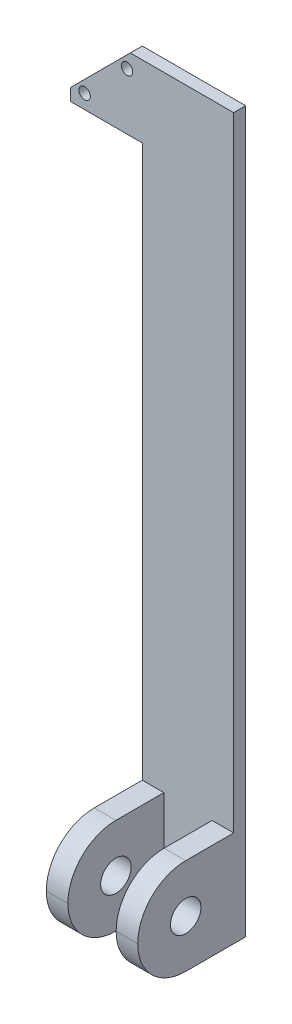
ISO-10303-21;
HEADER;
FILE_DESCRIPTION(('STEP AP214'),'2;1');
FILE_NAME('part.step','',(''),(''),'','','');
FILE_SCHEMA(('AUTOMOTIVE_DESIGN { 1 0 10303 214 1 1 1 1 }'));
ENDSEC;
DATA;
#1=APPLICATION_CONTEXT('core data for automotive mechanical design processes');
#2=APPLICATION_PROTOCOL_DEFINITION('international standard','automotive_design',2000,#1);
#3=PRODUCT_CONTEXT('',#1,'mechanical');
#4=PRODUCT('Part','Part','',(#3));
#5=PRODUCT_RELATED_PRODUCT_CATEGORY('part','',(#4));
#6=PRODUCT_DEFINITION_FORMATION('','',#4);
#7=PRODUCT_DEFINITION_CONTEXT('part definition',#1,'design');
#8=PRODUCT_DEFINITION('design','',#6,#7);
#9=PRODUCT_DEFINITION_SHAPE('','',#8);
#10=(LENGTH_UNIT() NAMED_UNIT(*) SI_UNIT(.MILLI.,.METRE.));
#11=(NAMED_UNIT(*) PLANE_ANGLE_UNIT() SI_UNIT($,.RADIAN.));
#12=(NAMED_UNIT(*) SI_UNIT($,.STERADIAN.) SOLID_ANGLE_UNIT());
#13=UNCERTAINTY_MEASURE_WITH_UNIT(LENGTH_MEASURE(1.E-05),#10,'distance_accuracy_value','');
#14=(GEOMETRIC_REPRESENTATION_CONTEXT(3) GLOBAL_UNCERTAINTY_ASSIGNED_CONTEXT((#13)) GLOBAL_UNIT_ASSIGNED_CONTEXT((#10,
#11,#12)) REPRESENTATION_CONTEXT('',''));
#15=CARTESIAN_POINT('',(0.,0.,0.));
#16=DIRECTION('',(0.,0.,1.));
#17=DIRECTION('',(1.,0.,0.));
#18=AXIS2_PLACEMENT_3D('',#15,#16,#17);
#19=CARTESIAN_POINT('',(0.,0.,45.));
#20=DIRECTION('',(0.,0.,1.));
#21=DIRECTION('',(1.,0.,0.));
#22=AXIS2_PLACEMENT_3D('',#19,#20,#21);
#23=PLANE('',#22);
#24=DIRECTION('',(1.,0.,0.));
#25=VECTOR('',#24,1.);
#26=CARTESIAN_POINT('',(-1.90000000000001,19.9900000000001,45.));
#27=LINE('',#26,#25);
#28=CARTESIAN_POINT('',(0.,19.9900000000001,45.));
#29=VERTEX_POINT('',#28);
#30=CARTESIAN_POINT('',(9.,19.99,45.));
#31=VERTEX_POINT('',#30);
#32=EDGE_CURVE('E203',#29,#31,#27,.T.);
#33=ORIENTED_EDGE('',*,*,#32,.T.);
#34=DIRECTION('',(0.,-1.,0.));
#35=VECTOR('',#34,1.);
#36=CARTESIAN_POINT('',(9.00000000000001,0.,45.));
#37=LINE('',#36,#35);
#38=CARTESIAN_POINT('',(9.,20.0099999999999,45.));
#39=VERTEX_POINT('',#38);
#40=EDGE_CURVE('E225',#39,#31,#37,.T.);
#41=ORIENTED_EDGE('',*,*,#40,.F.);
#42=DIRECTION('',(1.,0.,0.));
#43=VECTOR('',#42,1.);
#44=CARTESIAN_POINT('',(-1.90000000000001,20.0099999999999,45.));
#45=LINE('',#44,#43);
#46=CARTESIAN_POINT('',(0.,20.01,45.));
#47=VERTEX_POINT('',#46);
#48=EDGE_CURVE('E202',#47,#39,#45,.T.);
#49=ORIENTED_EDGE('',*,*,#48,.F.);
#50=DIRECTION('',(0.,-1.,0.));
#51=VECTOR('',#50,1.);
#52=CARTESIAN_POINT('',(0.,0.,45.));
#53=LINE('',#52,#51);
#54=EDGE_CURVE('E228',#47,#29,#53,.T.);
#55=ORIENTED_EDGE('',*,*,#54,.T.);
#56=EDGE_LOOP('',(#33,#41,#49,#55));
#57=FACE_BOUND('',#56,.T.);
#58=ADVANCED_FACE('F64',(#57),#23,.T.);
#59=CARTESIAN_POINT('',(0.,0.,45.));
#60=DIRECTION('',(0.,0.,1.));
#61=DIRECTION('',(1.,0.,0.));
#62=AXIS2_PLACEMENT_3D('',#59,#60,#61);
#63=PLANE('',#62);
#64=DIRECTION('',(1.,0.,0.));
#65=VECTOR('',#64,1.);
#66=CARTESIAN_POINT('',(-1.90000000000001,19.99,45.));
#67=LINE('',#66,#65);
#68=CARTESIAN_POINT('',(38.1,19.9900000000001,45.));
#69=VERTEX_POINT('',#68);
#70=CARTESIAN_POINT('',(29.1,19.9900000000001,45.));
#71=VERTEX_POINT('',#70);
#72=EDGE_CURVE('E12',#69,#71,#67,.F.);
#73=ORIENTED_EDGE('',*,*,#72,.F.);
#74=DIRECTION('',(0.,1.,0.));
#75=VECTOR('',#74,1.);
#76=CARTESIAN_POINT('',(38.1,0.,45.));
#77=LINE('',#76,#75);
#78=CARTESIAN_POINT('',(38.1,20.0099999999999,45.));
#79=VERTEX_POINT('',#78);
#80=EDGE_CURVE('E199',#69,#79,#77,.T.);
#81=ORIENTED_EDGE('',*,*,#80,.T.);
#82=DIRECTION('',(1.,0.,0.));
#83=VECTOR('',#82,1.);
#84=CARTESIAN_POINT('',(-1.90000000000001,20.01,45.));
#85=LINE('',#84,#83);
#86=CARTESIAN_POINT('',(29.1,20.01,45.));
#87=VERTEX_POINT('',#86);
#88=EDGE_CURVE('E73',#79,#87,#85,.F.);
#89=ORIENTED_EDGE('',*,*,#88,.T.);
#90=DIRECTION('',(0.,-1.,0.));
#91=VECTOR('',#90,1.);
#92=CARTESIAN_POINT('',(29.1,0.,45.));
#93=LINE('',#92,#91);
#94=EDGE_CURVE('E207',#87,#71,#93,.T.);
#95=ORIENTED_EDGE('',*,*,#94,.T.);
#96=EDGE_LOOP('',(#73,#81,#89,#95));
#97=FACE_BOUND('',#96,.T.);
#98=ADVANCED_FACE('F206',(#97),#63,.T.);
#99=CARTESIAN_POINT('',(0.,0.,5.));
#100=DIRECTION('',(0.,0.,1.));
#101=DIRECTION('',(1.,0.,0.));
#102=AXIS2_PLACEMENT_3D('',#99,#100,#101);
#103=PLANE('',#102);
#104=DIRECTION('',(1.,0.,0.));
#105=VECTOR('',#104,1.);
#106=CARTESIAN_POINT('',(0.,40.,5.));
#107=LINE('',#106,#105);
#108=CARTESIAN_POINT('',(29.1,40.,5.));
#109=VERTEX_POINT('',#108);
#110=CARTESIAN_POINT('',(38.1,40.,5.));
#111=VERTEX_POINT('',#110);
#112=EDGE_CURVE('E215',#109,#111,#107,.T.);
#113=ORIENTED_EDGE('',*,*,#112,.T.);
#114=DIRECTION('',(0.,1.,0.));
#115=VECTOR('',#114,1.);
#116=CARTESIAN_POINT('',(38.1,0.,5.));
#117=LINE('',#116,#115);
#118=CARTESIAN_POINT('',(38.0999999999999,300.,5.));
#119=VERTEX_POINT('',#118);
#120=EDGE_CURVE('E255',#111,#119,#117,.T.);
#121=ORIENTED_EDGE('',*,*,#120,.T.);
#122=DIRECTION('',(-1.,0.,0.));
#123=VECTOR('',#122,1.);
#124=CARTESIAN_POINT('',(0.,300.,5.));
#125=LINE('',#124,#123);
#126=CARTESIAN_POINT('',(-4.9999999999999,300.,5.));
#127=VERTEX_POINT('',#126);
#128=EDGE_CURVE('E257',#119,#127,#125,.T.);
#129=ORIENTED_EDGE('',*,*,#128,.T.);
#130=DIRECTION('',(0.707106781186548,0.707106781186547,0.));
#131=VECTOR('',#130,1.);
#132=CARTESIAN_POINT('',(-152.5,152.5,5.));
#133=LINE('',#132,#131);
#134=CARTESIAN_POINT('',(-30.,275.,5.));
#135=VERTEX_POINT('',#134);
#136=EDGE_CURVE('E259',#135,#127,#133,.T.);
#137=ORIENTED_EDGE('',*,*,#136,.F.);
#138=DIRECTION('',(0.,-1.,0.));
#139=VECTOR('',#138,1.);
#140=CARTESIAN_POINT('',(-30.,0.,5.));
#141=LINE('',#140,#139);
#142=CARTESIAN_POINT('',(-29.9999999999999,270.,5.));
#143=VERTEX_POINT('',#142);
#144=EDGE_CURVE('E262',#135,#143,#141,.T.);
#145=ORIENTED_EDGE('',*,*,#144,.T.);
#146=DIRECTION('',(-1.,0.,0.));
#147=VECTOR('',#146,1.);
#148=CARTESIAN_POINT('',(0.,270.,5.));
#149=LINE('',#148,#147);
#150=CARTESIAN_POINT('',(0.,270.,5.));
#151=VERTEX_POINT('',#150);
#152=EDGE_CURVE('E246',#151,#143,#149,.T.);
#153=ORIENTED_EDGE('',*,*,#152,.F.);
#154=DIRECTION('',(0.,1.,0.));
#155=VECTOR('',#154,1.);
#156=CARTESIAN_POINT('',(0.,0.,5.));
#157=LINE('',#156,#155);
#158=CARTESIAN_POINT('',(0.,40.,5.));
#159=VERTEX_POINT('',#158);
#160=EDGE_CURVE('E250',#159,#151,#157,.T.);
#161=ORIENTED_EDGE('',*,*,#160,.F.);
#162=DIRECTION('',(1.,0.,0.));
#163=VECTOR('',#162,1.);
#164=CARTESIAN_POINT('',(0.,40.,5.));
#165=LINE('',#164,#163);
#166=CARTESIAN_POINT('',(9.,40.,5.));
#167=VERTEX_POINT('',#166);
#168=EDGE_CURVE('E229',#159,#167,#165,.T.);
#169=ORIENTED_EDGE('',*,*,#168,.T.);
#170=DIRECTION('',(0.,-1.,0.));
#171=VECTOR('',#170,1.);
#172=CARTESIAN_POINT('',(9.00000000000001,0.,5.));
#173=LINE('',#172,#171);
#174=CARTESIAN_POINT('',(9.,0.,5.));
#175=VERTEX_POINT('',#174);
#176=EDGE_CURVE('E224',#167,#175,#173,.T.);
#177=ORIENTED_EDGE('',*,*,#176,.T.);
#178=DIRECTION('',(1.,0.,0.));
#179=VECTOR('',#178,1.);
#180=CARTESIAN_POINT('',(0.,0.,5.));
#181=LINE('',#180,#179);
#182=CARTESIAN_POINT('',(29.1,0.,5.));
#183=VERTEX_POINT('',#182);
#184=EDGE_CURVE('E252',#175,#183,#181,.T.);
#185=ORIENTED_EDGE('',*,*,#184,.T.);
#186=DIRECTION('',(0.,-1.,0.));
#187=VECTOR('',#186,1.);
#188=CARTESIAN_POINT('',(29.1,0.,5.));
#189=LINE('',#188,#187);
#190=EDGE_CURVE('E211',#109,#183,#189,.T.);
#191=ORIENTED_EDGE('',*,*,#190,.F.);
#192=EDGE_LOOP('',(#113,#121,#129,#137,#145,#153,#161,#169,#177,#185,#191));
#193=FACE_BOUND('',#192,.T.);
#194=CARTESIAN_POINT('',(-6.36396103067894,293.636038969321,5.));
#195=DIRECTION('',(0.,0.,1.));
#196=DIRECTION('',(1.,0.,0.));
#197=AXIS2_PLACEMENT_3D('',#194,#195,#196);
#198=CIRCLE('',#197,2.38125000000002);
#199=CARTESIAN_POINT('',(-3.98271103067892,293.636038969321,5.));
#200=VERTEX_POINT('',#199);
#201=EDGE_CURVE('E243',#200,#200,#198,.T.);
#202=ORIENTED_EDGE('',*,*,#201,.F.);
#203=EDGE_LOOP('',(#202));
#204=FACE_BOUND('',#203,.T.);
#205=CARTESIAN_POINT('',(-24.0416305603427,275.958369439657,5.));
#206=DIRECTION('',(0.,0.,1.));
#207=DIRECTION('',(1.,0.,0.));
#208=AXIS2_PLACEMENT_3D('',#205,#206,#207);
#209=CIRCLE('',#208,2.38125000000002);
#210=CARTESIAN_POINT('',(-21.6603805603427,275.958369439657,5.));
#211=VERTEX_POINT('',#210);
#212=EDGE_CURVE('E264',#211,#211,#209,.T.);
#213=ORIENTED_EDGE('',*,*,#212,.F.);
#214=EDGE_LOOP('',(#213));
#215=FACE_BOUND('',#214,.T.);
#216=ADVANCED_FACE('F372',(#193,#204,#215),#103,.T.);
#217=CARTESIAN_POINT('',(0.,270.,5.));
#218=DIRECTION('',(0.,-1.,0.));
#219=DIRECTION('',(0.,0.,-1.));
#220=AXIS2_PLACEMENT_3D('',#217,#218,#219);
#221=PLANE('',#220);
#222=DIRECTION('',(-1.,0.,0.));
#223=VECTOR('',#222,1.);
#224=CARTESIAN_POINT('',(0.,270.,0.));
#225=LINE('',#224,#223);
#226=CARTESIAN_POINT('',(0.,270.,0.));
#227=VERTEX_POINT('',#226);
#228=CARTESIAN_POINT('',(-29.9999999999999,270.,0.));
#229=VERTEX_POINT('',#228);
#230=EDGE_CURVE('E270',#227,#229,#225,.T.);
#231=ORIENTED_EDGE('',*,*,#230,.F.);
#232=DIRECTION('',(0.,0.,-1.));
#233=VECTOR('',#232,1.);
#234=CARTESIAN_POINT('',(0.,270.,5.));
#235=LINE('',#234,#233);
#236=EDGE_CURVE('E192',#151,#227,#235,.T.);
#237=ORIENTED_EDGE('',*,*,#236,.F.);
#238=ORIENTED_EDGE('',*,*,#152,.T.);
#239=DIRECTION('',(0.,0.,-1.));
#240=VECTOR('',#239,1.);
#241=CARTESIAN_POINT('',(-29.9999999999999,270.,5.));
#242=LINE('',#241,#240);
#243=EDGE_CURVE('E267',#143,#229,#242,.T.);
#244=ORIENTED_EDGE('',*,*,#243,.T.);
#245=EDGE_LOOP('',(#231,#237,#238,#244));
#246=FACE_BOUND('',#245,.T.);
#247=ADVANCED_FACE('F316',(#246),#221,.T.);
#248=CARTESIAN_POINT('',(0.,0.,5.));
#249=DIRECTION('',(-1.,0.,0.));
#250=DIRECTION('',(0.,0.,1.));
#251=AXIS2_PLACEMENT_3D('',#248,#249,#250);
#252=PLANE('',#251);
#253=CARTESIAN_POINT('',(0.,19.99,25.01));
#254=DIRECTION('',(-1.,0.,0.));
#255=DIRECTION('',(0.,0.,1.));
#256=AXIS2_PLACEMENT_3D('',#253,#254,#255);
#257=CIRCLE('',#256,19.99);
#258=CARTESIAN_POINT('',(0.,0.,25.0099999999999));
#259=VERTEX_POINT('',#258);
#260=EDGE_CURVE('E332',#29,#259,#257,.F.);
#261=ORIENTED_EDGE('',*,*,#260,.F.);
#262=ORIENTED_EDGE('',*,*,#54,.F.);
#263=CARTESIAN_POINT('',(0.,20.01,25.01));
#264=DIRECTION('',(-1.,0.,0.));
#265=DIRECTION('',(0.,0.,1.));
#266=AXIS2_PLACEMENT_3D('',#263,#264,#265);
#267=CIRCLE('',#266,19.99);
#268=CARTESIAN_POINT('',(0.,40.,25.0099999999999));
#269=VERTEX_POINT('',#268);
#270=EDGE_CURVE('E80',#269,#47,#267,.F.);
#271=ORIENTED_EDGE('',*,*,#270,.F.);
#272=DIRECTION('',(0.,0.,-1.));
#273=VECTOR('',#272,1.);
#274=CARTESIAN_POINT('',(0.,40.,45.));
#275=LINE('',#274,#273);
#276=EDGE_CURVE('E238',#269,#159,#275,.T.);
#277=ORIENTED_EDGE('',*,*,#276,.T.);
#278=ORIENTED_EDGE('',*,*,#160,.T.);
#279=ORIENTED_EDGE('',*,*,#236,.T.);
#280=DIRECTION('',(0.,1.,0.));
#281=VECTOR('',#280,1.);
#282=CARTESIAN_POINT('',(0.,0.,0.));
#283=LINE('',#282,#281);
#284=CARTESIAN_POINT('',(0.,0.,0.));
#285=VERTEX_POINT('',#284);
#286=EDGE_CURVE('E273',#285,#227,#283,.T.);
#287=ORIENTED_EDGE('',*,*,#286,.F.);
#288=DIRECTION('',(0.,0.,-1.));
#289=VECTOR('',#288,1.);
#290=CARTESIAN_POINT('',(0.,0.,5.));
#291=LINE('',#290,#289);
#292=EDGE_CURVE('E303',#259,#285,#291,.T.);
#293=ORIENTED_EDGE('',*,*,#292,.F.);
#294=EDGE_LOOP('',(#261,#262,#271,#277,#278,#279,#287,#293));
#295=FACE_BOUND('',#294,.T.);
#296=CARTESIAN_POINT('',(0.,20.,25.));
#297=DIRECTION('',(-1.,0.,0.));
#298=DIRECTION('',(0.,0.,1.));
#299=AXIS2_PLACEMENT_3D('',#296,#297,#298);
#300=CIRCLE('',#299,6.35);
#301=CARTESIAN_POINT('',(0.,20.,31.35));
#302=VERTEX_POINT('',#301);
#303=EDGE_CURVE('E218',#302,#302,#300,.T.);
#304=ORIENTED_EDGE('',*,*,#303,.F.);
#305=EDGE_LOOP('',(#304));
#306=FACE_BOUND('',#305,.T.);
#307=ADVANCED_FACE('F310',(#295,#306),#252,.T.);
#308=CARTESIAN_POINT('',(0.,0.,5.));
#309=DIRECTION('',(0.,1.,0.));
#310=DIRECTION('',(0.,0.,1.));
#311=AXIS2_PLACEMENT_3D('',#308,#309,#310);
#312=PLANE('',#311);
#313=DIRECTION('',(0.,0.,-1.));
#314=VECTOR('',#313,1.);
#315=CARTESIAN_POINT('',(38.1,0.,5.));
#316=LINE('',#315,#314);
#317=CARTESIAN_POINT('',(38.1,0.,25.0099999999999));
#318=VERTEX_POINT('',#317);
#319=CARTESIAN_POINT('',(38.1,0.,0.));
#320=VERTEX_POINT('',#319);
#321=EDGE_CURVE('E301',#318,#320,#316,.T.);
#322=ORIENTED_EDGE('',*,*,#321,.F.);
#323=DIRECTION('',(1.,0.,0.));
#324=VECTOR('',#323,1.);
#325=CARTESIAN_POINT('',(-1.90000000000001,0.,25.0099999999999));
#326=LINE('',#325,#324);
#327=CARTESIAN_POINT('',(29.1,0.,25.0099999999999));
#328=VERTEX_POINT('',#327);
#329=EDGE_CURVE('E344',#328,#318,#326,.T.);
#330=ORIENTED_EDGE('',*,*,#329,.F.);
#331=DIRECTION('',(0.,0.,-1.));
#332=VECTOR('',#331,1.);
#333=CARTESIAN_POINT('',(29.1,0.,45.));
#334=LINE('',#333,#332);
#335=EDGE_CURVE('E209',#328,#183,#334,.T.);
#336=ORIENTED_EDGE('',*,*,#335,.T.);
#337=ORIENTED_EDGE('',*,*,#184,.F.);
#338=DIRECTION('',(0.,0.,-1.));
#339=VECTOR('',#338,1.);
#340=CARTESIAN_POINT('',(9.,0.,45.));
#341=LINE('',#340,#339);
#342=CARTESIAN_POINT('',(9.00000000000001,0.,25.0099999999999));
#343=VERTEX_POINT('',#342);
#344=EDGE_CURVE('E232',#343,#175,#341,.T.);
#345=ORIENTED_EDGE('',*,*,#344,.F.);
#346=EDGE_CURVE('E330',#259,#343,#326,.T.);
#347=ORIENTED_EDGE('',*,*,#346,.F.);
#348=ORIENTED_EDGE('',*,*,#292,.T.);
#349=DIRECTION('',(1.,0.,0.));
#350=VECTOR('',#349,1.);
#351=CARTESIAN_POINT('',(0.,0.,0.));
#352=LINE('',#351,#350);
#353=EDGE_CURVE('E276',#285,#320,#352,.T.);
#354=ORIENTED_EDGE('',*,*,#353,.T.);
#355=EDGE_LOOP('',(#322,#330,#336,#337,#345,#347,#348,#354));
#356=FACE_BOUND('',#355,.T.);
#357=ADVANCED_FACE('F326',(#356),#312,.F.);
#358=CARTESIAN_POINT('',(38.1,0.,5.));
#359=DIRECTION('',(-1.,0.,0.));
#360=DIRECTION('',(0.,-1.,0.));
#361=AXIS2_PLACEMENT_3D('',#358,#359,#360);
#362=PLANE('',#361);
#363=CARTESIAN_POINT('',(38.1,20.,25.));
#364=DIRECTION('',(1.,0.,0.));
#365=DIRECTION('',(0.,1.,0.));
#366=AXIS2_PLACEMENT_3D('',#363,#364,#365);
#367=CIRCLE('',#366,6.35);
#368=CARTESIAN_POINT('',(38.1,26.35,25.));
#369=VERTEX_POINT('',#368);
#370=EDGE_CURVE('E347',#369,#369,#367,.T.);
#371=ORIENTED_EDGE('',*,*,#370,.F.);
#372=EDGE_LOOP('',(#371));
#373=FACE_BOUND('',#372,.T.);
#374=ORIENTED_EDGE('',*,*,#80,.F.);
#375=CARTESIAN_POINT('',(38.1,19.99,25.01));
#376=DIRECTION('',(1.,0.,0.));
#377=DIRECTION('',(0.,1.,0.));
#378=AXIS2_PLACEMENT_3D('',#375,#376,#377);
#379=CIRCLE('',#378,19.99);
#380=EDGE_CURVE('E342',#318,#69,#379,.F.);
#381=ORIENTED_EDGE('',*,*,#380,.F.);
#382=ORIENTED_EDGE('',*,*,#321,.T.);
#383=DIRECTION('',(0.,1.,0.));
#384=VECTOR('',#383,1.);
#385=CARTESIAN_POINT('',(38.1,0.,0.));
#386=LINE('',#385,#384);
#387=CARTESIAN_POINT('',(38.0999999999999,300.,0.));
#388=VERTEX_POINT('',#387);
#389=EDGE_CURVE('E279',#320,#388,#386,.T.);
#390=ORIENTED_EDGE('',*,*,#389,.T.);
#391=DIRECTION('',(0.,0.,-1.));
#392=VECTOR('',#391,1.);
#393=CARTESIAN_POINT('',(38.0999999999999,300.,5.));
#394=LINE('',#393,#392);
#395=EDGE_CURVE('E298',#119,#388,#394,.T.);
#396=ORIENTED_EDGE('',*,*,#395,.F.);
#397=ORIENTED_EDGE('',*,*,#120,.F.);
#398=DIRECTION('',(0.,0.,-1.));
#399=VECTOR('',#398,1.);
#400=CARTESIAN_POINT('',(38.1,40.,45.));
#401=LINE('',#400,#399);
#402=CARTESIAN_POINT('',(38.1,40.,25.0099999999999));
#403=VERTEX_POINT('',#402);
#404=EDGE_CURVE('E201',#403,#111,#401,.T.);
#405=ORIENTED_EDGE('',*,*,#404,.F.);
#406=CARTESIAN_POINT('',(38.1,20.01,25.01));
#407=DIRECTION('',(1.,0.,0.));
#408=DIRECTION('',(0.,1.,0.));
#409=AXIS2_PLACEMENT_3D('',#406,#407,#408);
#410=CIRCLE('',#409,19.99);
#411=EDGE_CURVE('E184',#79,#403,#410,.F.);
#412=ORIENTED_EDGE('',*,*,#411,.F.);
#413=EDGE_LOOP('',(#374,#381,#382,#390,#396,#397,#405,#412));
#414=FACE_BOUND('',#413,.T.);
#415=ADVANCED_FACE('F197',(#373,#414),#362,.F.);
#416=CARTESIAN_POINT('',(0.,300.,5.));
#417=DIRECTION('',(0.,-1.,0.));
#418=DIRECTION('',(0.,0.,-1.));
#419=AXIS2_PLACEMENT_3D('',#416,#417,#418);
#420=PLANE('',#419);
#421=DIRECTION('',(-1.,0.,0.));
#422=VECTOR('',#421,1.);
#423=CARTESIAN_POINT('',(0.,300.,0.));
#424=LINE('',#423,#422);
#425=CARTESIAN_POINT('',(-4.9999999999999,300.,0.));
#426=VERTEX_POINT('',#425);
#427=EDGE_CURVE('E282',#388,#426,#424,.T.);
#428=ORIENTED_EDGE('',*,*,#427,.T.);
#429=DIRECTION('',(0.,0.,-1.));
#430=VECTOR('',#429,1.);
#431=CARTESIAN_POINT('',(-4.9999999999999,300.,5.));
#432=LINE('',#431,#430);
#433=EDGE_CURVE('E296',#127,#426,#432,.T.);
#434=ORIENTED_EDGE('',*,*,#433,.F.);
#435=ORIENTED_EDGE('',*,*,#128,.F.);
#436=ORIENTED_EDGE('',*,*,#395,.T.);
#437=EDGE_LOOP('',(#428,#434,#435,#436));
#438=FACE_BOUND('',#437,.T.);
#439=ADVANCED_FACE('F408',(#438),#420,.F.);
#440=CARTESIAN_POINT('',(-152.5,152.5,5.));
#441=DIRECTION('',(-0.707106781186547,0.707106781186548,0.));
#442=DIRECTION('',(-0.707106781186548,-0.707106781186547,0.));
#443=AXIS2_PLACEMENT_3D('',#440,#441,#442);
#444=PLANE('',#443);
#445=DIRECTION('',(0.707106781186548,0.707106781186547,0.));
#446=VECTOR('',#445,1.);
#447=CARTESIAN_POINT('',(-152.5,152.5,0.));
#448=LINE('',#447,#446);
#449=CARTESIAN_POINT('',(-30.,275.,0.));
#450=VERTEX_POINT('',#449);
#451=EDGE_CURVE('E285',#450,#426,#448,.T.);
#452=ORIENTED_EDGE('',*,*,#451,.F.);
#453=DIRECTION('',(0.,0.,-1.));
#454=VECTOR('',#453,1.);
#455=CARTESIAN_POINT('',(-30.,275.,5.));
#456=LINE('',#455,#454);
#457=EDGE_CURVE('E294',#135,#450,#456,.T.);
#458=ORIENTED_EDGE('',*,*,#457,.F.);
#459=ORIENTED_EDGE('',*,*,#136,.T.);
#460=ORIENTED_EDGE('',*,*,#433,.T.);
#461=EDGE_LOOP('',(#452,#458,#459,#460));
#462=FACE_BOUND('',#461,.T.);
#463=ADVANCED_FACE('F404',(#462),#444,.T.);
#464=CARTESIAN_POINT('',(-30.,0.,5.));
#465=DIRECTION('',(1.,0.,0.));
#466=DIRECTION('',(0.,0.,-1.));
#467=AXIS2_PLACEMENT_3D('',#464,#465,#466);
#468=PLANE('',#467);
#469=DIRECTION('',(0.,-1.,0.));
#470=VECTOR('',#469,1.);
#471=CARTESIAN_POINT('',(-30.,0.,0.));
#472=LINE('',#471,#470);
#473=EDGE_CURVE('E288',#450,#229,#472,.T.);
#474=ORIENTED_EDGE('',*,*,#473,.T.);
#475=ORIENTED_EDGE('',*,*,#243,.F.);
#476=ORIENTED_EDGE('',*,*,#144,.F.);
#477=ORIENTED_EDGE('',*,*,#457,.T.);
#478=EDGE_LOOP('',(#474,#475,#476,#477));
#479=FACE_BOUND('',#478,.T.);
#480=ADVANCED_FACE('F401',(#479),#468,.F.);
#481=CARTESIAN_POINT('',(-6.36396103067894,293.636038969321,5.));
#482=DIRECTION('',(0.,0.,-1.));
#483=DIRECTION('',(-1.,0.,0.));
#484=AXIS2_PLACEMENT_3D('',#481,#482,#483);
#485=CYLINDRICAL_SURFACE('',#484,2.38125000000002);
#486=ORIENTED_EDGE('',*,*,#201,.T.);
#487=EDGE_LOOP('',(#486));
#488=FACE_BOUND('',#487,.T.);
#489=CARTESIAN_POINT('',(-6.36396103067894,293.636038969321,0.));
#490=DIRECTION('',(0.,0.,1.));
#491=DIRECTION('',(1.,0.,0.));
#492=AXIS2_PLACEMENT_3D('',#489,#490,#491);
#493=CIRCLE('',#492,2.38125000000002);
#494=CARTESIAN_POINT('',(-3.98271103067892,293.636038969321,0.));
#495=VERTEX_POINT('',#494);
#496=EDGE_CURVE('E242',#495,#495,#493,.T.);
#497=ORIENTED_EDGE('',*,*,#496,.F.);
#498=EDGE_LOOP('',(#497));
#499=FACE_BOUND('',#498,.T.);
#500=ADVANCED_FACE('F66',(#488,#499),#485,.F.);
#501=CARTESIAN_POINT('',(-24.0416305603427,275.958369439657,5.));
#502=DIRECTION('',(0.,0.,-1.));
#503=DIRECTION('',(-1.,0.,0.));
#504=AXIS2_PLACEMENT_3D('',#501,#502,#503);
#505=CYLINDRICAL_SURFACE('',#504,2.38125000000002);
#506=ORIENTED_EDGE('',*,*,#212,.T.);
#507=EDGE_LOOP('',(#506));
#508=FACE_BOUND('',#507,.T.);
#509=CARTESIAN_POINT('',(-24.0416305603427,275.958369439657,0.));
#510=DIRECTION('',(0.,0.,1.));
#511=DIRECTION('',(1.,0.,0.));
#512=AXIS2_PLACEMENT_3D('',#509,#510,#511);
#513=CIRCLE('',#512,2.38125000000002);
#514=CARTESIAN_POINT('',(-21.6603805603427,275.958369439657,0.));
#515=VERTEX_POINT('',#514);
#516=EDGE_CURVE('E247',#515,#515,#513,.T.);
#517=ORIENTED_EDGE('',*,*,#516,.F.);
#518=EDGE_LOOP('',(#517));
#519=FACE_BOUND('',#518,.T.);
#520=ADVANCED_FACE('F396',(#508,#519),#505,.F.);
#521=CARTESIAN_POINT('',(0.,0.,0.));
#522=DIRECTION('',(0.,0.,1.));
#523=DIRECTION('',(1.,0.,0.));
#524=AXIS2_PLACEMENT_3D('',#521,#522,#523);
#525=PLANE('',#524);
#526=ORIENTED_EDGE('',*,*,#496,.T.);
#527=EDGE_LOOP('',(#526));
#528=FACE_BOUND('',#527,.T.);
#529=ORIENTED_EDGE('',*,*,#230,.T.);
#530=ORIENTED_EDGE('',*,*,#473,.F.);
#531=ORIENTED_EDGE('',*,*,#451,.T.);
#532=ORIENTED_EDGE('',*,*,#427,.F.);
#533=ORIENTED_EDGE('',*,*,#389,.F.);
#534=ORIENTED_EDGE('',*,*,#353,.F.);
#535=ORIENTED_EDGE('',*,*,#286,.T.);
#536=EDGE_LOOP('',(#529,#530,#531,#532,#533,#534,#535));
#537=FACE_BOUND('',#536,.T.);
#538=ORIENTED_EDGE('',*,*,#516,.T.);
#539=EDGE_LOOP('',(#538));
#540=FACE_BOUND('',#539,.T.);
#541=ADVANCED_FACE('F321',(#528,#537,#540),#525,.F.);
#542=CARTESIAN_POINT('',(9.00000000000001,0.,45.));
#543=DIRECTION('',(1.,0.,0.));
#544=DIRECTION('',(0.,1.,0.));
#545=AXIS2_PLACEMENT_3D('',#542,#543,#544);
#546=PLANE('',#545);
#547=CARTESIAN_POINT('',(9.,19.99,25.01));
#548=DIRECTION('',(1.,0.,0.));
#549=DIRECTION('',(0.,1.,0.));
#550=AXIS2_PLACEMENT_3D('',#547,#548,#549);
#551=CIRCLE('',#550,19.99);
#552=EDGE_CURVE('E88',#343,#31,#551,.F.);
#553=ORIENTED_EDGE('',*,*,#552,.F.);
#554=ORIENTED_EDGE('',*,*,#344,.T.);
#555=ORIENTED_EDGE('',*,*,#176,.F.);
#556=DIRECTION('',(0.,0.,-1.));
#557=VECTOR('',#556,1.);
#558=CARTESIAN_POINT('',(9.,40.,45.));
#559=LINE('',#558,#557);
#560=CARTESIAN_POINT('',(9.,40.,25.0099999999999));
#561=VERTEX_POINT('',#560);
#562=EDGE_CURVE('E240',#561,#167,#559,.T.);
#563=ORIENTED_EDGE('',*,*,#562,.F.);
#564=CARTESIAN_POINT('',(9.,20.01,25.01));
#565=DIRECTION('',(1.,0.,0.));
#566=DIRECTION('',(0.,1.,0.));
#567=AXIS2_PLACEMENT_3D('',#564,#565,#566);
#568=CIRCLE('',#567,19.99);
#569=EDGE_CURVE('E351',#39,#561,#568,.F.);
#570=ORIENTED_EDGE('',*,*,#569,.F.);
#571=ORIENTED_EDGE('',*,*,#40,.T.);
#572=EDGE_LOOP('',(#553,#554,#555,#563,#570,#571));
#573=FACE_BOUND('',#572,.T.);
#574=CARTESIAN_POINT('',(9.,20.,25.));
#575=DIRECTION('',(1.,0.,0.));
#576=DIRECTION('',(0.,1.,0.));
#577=AXIS2_PLACEMENT_3D('',#574,#575,#576);
#578=CIRCLE('',#577,6.35);
#579=CARTESIAN_POINT('',(9.,26.35,25.));
#580=VERTEX_POINT('',#579);
#581=EDGE_CURVE('E358',#580,#580,#578,.T.);
#582=ORIENTED_EDGE('',*,*,#581,.F.);
#583=EDGE_LOOP('',(#582));
#584=FACE_BOUND('',#583,.T.);
#585=ADVANCED_FACE('F386',(#573,#584),#546,.T.);
#586=CARTESIAN_POINT('',(0.,40.,45.));
#587=DIRECTION('',(0.,1.,0.));
#588=DIRECTION('',(0.,0.,1.));
#589=AXIS2_PLACEMENT_3D('',#586,#587,#588);
#590=PLANE('',#589);
#591=DIRECTION('',(1.,0.,0.));
#592=VECTOR('',#591,1.);
#593=CARTESIAN_POINT('',(-1.90000000000001,40.,25.0099999999999));
#594=LINE('',#593,#592);
#595=EDGE_CURVE('E339',#269,#561,#594,.T.);
#596=ORIENTED_EDGE('',*,*,#595,.T.);
#597=ORIENTED_EDGE('',*,*,#562,.T.);
#598=ORIENTED_EDGE('',*,*,#168,.F.);
#599=ORIENTED_EDGE('',*,*,#276,.F.);
#600=EDGE_LOOP('',(#596,#597,#598,#599));
#601=FACE_BOUND('',#600,.T.);
#602=ADVANCED_FACE('F383',(#601),#590,.T.);
#603=CARTESIAN_POINT('',(0.,40.,45.));
#604=DIRECTION('',(0.,1.,0.));
#605=DIRECTION('',(0.,0.,1.));
#606=AXIS2_PLACEMENT_3D('',#603,#604,#605);
#607=PLANE('',#606);
#608=CARTESIAN_POINT('',(29.1,40.,25.0099999999999));
#609=VERTEX_POINT('',#608);
#610=EDGE_CURVE('E337',#609,#403,#594,.T.);
#611=ORIENTED_EDGE('',*,*,#610,.T.);
#612=ORIENTED_EDGE('',*,*,#404,.T.);
#613=ORIENTED_EDGE('',*,*,#112,.F.);
#614=DIRECTION('',(0.,0.,-1.));
#615=VECTOR('',#614,1.);
#616=CARTESIAN_POINT('',(29.1,40.,45.));
#617=LINE('',#616,#615);
#618=EDGE_CURVE('E222',#609,#109,#617,.T.);
#619=ORIENTED_EDGE('',*,*,#618,.F.);
#620=EDGE_LOOP('',(#611,#612,#613,#619));
#621=FACE_BOUND('',#620,.T.);
#622=ADVANCED_FACE('F381',(#621),#607,.T.);
#623=CARTESIAN_POINT('',(29.1,0.,45.));
#624=DIRECTION('',(1.,0.,0.));
#625=DIRECTION('',(0.,1.,0.));
#626=AXIS2_PLACEMENT_3D('',#623,#624,#625);
#627=PLANE('',#626);
#628=CARTESIAN_POINT('',(29.1,20.,25.));
#629=DIRECTION('',(1.,0.,0.));
#630=DIRECTION('',(0.,1.,0.));
#631=AXIS2_PLACEMENT_3D('',#628,#629,#630);
#632=CIRCLE('',#631,6.35);
#633=CARTESIAN_POINT('',(29.1,26.35,25.));
#634=VERTEX_POINT('',#633);
#635=EDGE_CURVE('E68',#634,#634,#632,.T.);
#636=ORIENTED_EDGE('',*,*,#635,.T.);
#637=EDGE_LOOP('',(#636));
#638=FACE_BOUND('',#637,.T.);
#639=ORIENTED_EDGE('',*,*,#335,.F.);
#640=CARTESIAN_POINT('',(29.1,19.99,25.01));
#641=DIRECTION('',(1.,0.,0.));
#642=DIRECTION('',(0.,1.,0.));
#643=AXIS2_PLACEMENT_3D('',#640,#641,#642);
#644=CIRCLE('',#643,19.99);
#645=EDGE_CURVE('E354',#328,#71,#644,.F.);
#646=ORIENTED_EDGE('',*,*,#645,.T.);
#647=ORIENTED_EDGE('',*,*,#94,.F.);
#648=CARTESIAN_POINT('',(29.1,20.01,25.01));
#649=DIRECTION('',(1.,0.,0.));
#650=DIRECTION('',(0.,1.,0.));
#651=AXIS2_PLACEMENT_3D('',#648,#649,#650);
#652=CIRCLE('',#651,19.99);
#653=EDGE_CURVE('E187',#87,#609,#652,.F.);
#654=ORIENTED_EDGE('',*,*,#653,.T.);
#655=ORIENTED_EDGE('',*,*,#618,.T.);
#656=ORIENTED_EDGE('',*,*,#190,.T.);
#657=EDGE_LOOP('',(#639,#646,#647,#654,#655,#656));
#658=FACE_BOUND('',#657,.T.);
#659=ADVANCED_FACE('F428',(#638,#658),#627,.F.);
#660=CARTESIAN_POINT('',(-1.90000000000001,20.01,25.01));
#661=DIRECTION('',(1.,0.,0.));
#662=DIRECTION('',(0.,1.,0.));
#663=AXIS2_PLACEMENT_3D('',#660,#661,#662);
#664=CYLINDRICAL_SURFACE('',#663,19.99);
#665=ORIENTED_EDGE('',*,*,#88,.F.);
#666=ORIENTED_EDGE('',*,*,#411,.T.);
#667=ORIENTED_EDGE('',*,*,#610,.F.);
#668=ORIENTED_EDGE('',*,*,#653,.F.);
#669=EDGE_LOOP('',(#665,#666,#667,#668));
#670=FACE_BOUND('',#669,.T.);
#671=ADVANCED_FACE('F183',(#670),#664,.T.);
#672=CARTESIAN_POINT('',(-1.90000000000001,19.99,25.01));
#673=DIRECTION('',(1.,0.,0.));
#674=DIRECTION('',(0.,1.,0.));
#675=AXIS2_PLACEMENT_3D('',#672,#673,#674);
#676=CYLINDRICAL_SURFACE('',#675,19.99);
#677=ORIENTED_EDGE('',*,*,#329,.T.);
#678=ORIENTED_EDGE('',*,*,#380,.T.);
#679=ORIENTED_EDGE('',*,*,#72,.T.);
#680=ORIENTED_EDGE('',*,*,#645,.F.);
#681=EDGE_LOOP('',(#677,#678,#679,#680));
#682=FACE_BOUND('',#681,.T.);
#683=ADVANCED_FACE('F423',(#682),#676,.T.);
#684=CARTESIAN_POINT('',(-1.90000000000001,20.,25.));
#685=DIRECTION('',(1.,0.,0.));
#686=DIRECTION('',(0.,1.,0.));
#687=AXIS2_PLACEMENT_3D('',#684,#685,#686);
#688=CYLINDRICAL_SURFACE('',#687,6.35);
#689=ORIENTED_EDGE('',*,*,#370,.T.);
#690=EDGE_LOOP('',(#689));
#691=FACE_BOUND('',#690,.T.);
#692=ORIENTED_EDGE('',*,*,#635,.F.);
#693=EDGE_LOOP('',(#692));
#694=FACE_BOUND('',#693,.T.);
#695=ADVANCED_FACE('F419',(#691,#694),#688,.F.);
#696=ORIENTED_EDGE('',*,*,#270,.T.);
#697=ORIENTED_EDGE('',*,*,#48,.T.);
#698=ORIENTED_EDGE('',*,*,#569,.T.);
#699=ORIENTED_EDGE('',*,*,#595,.F.);
#700=EDGE_LOOP('',(#696,#697,#698,#699));
#701=FACE_BOUND('',#700,.T.);
#702=ADVANCED_FACE('F422',(#701),#664,.T.);
#703=ORIENTED_EDGE('',*,*,#260,.T.);
#704=ORIENTED_EDGE('',*,*,#346,.T.);
#705=ORIENTED_EDGE('',*,*,#552,.T.);
#706=ORIENTED_EDGE('',*,*,#32,.F.);
#707=EDGE_LOOP('',(#703,#704,#705,#706));
#708=FACE_BOUND('',#707,.T.);
#709=ADVANCED_FACE('F451',(#708),#676,.T.);
#710=ORIENTED_EDGE('',*,*,#303,.T.);
#711=EDGE_LOOP('',(#710));
#712=FACE_BOUND('',#711,.T.);
#713=ORIENTED_EDGE('',*,*,#581,.T.);
#714=EDGE_LOOP('',(#713));
#715=FACE_BOUND('',#714,.T.);
#716=ADVANCED_FACE('F363',(#712,#715),#688,.F.);
#717=CLOSED_SHELL('',(#58,#98,#216,#247,#307,#357,#415,#439,#463,#480,#500,#520,#541,#585,#602,
#622,#659,#671,#683,#695,#702,#709,#716));
#718=MANIFOLD_SOLID_BREP('B2',#717);
#719=ADVANCED_BREP_SHAPE_REPRESENTATION('',(#18,#718),#14);
#720=SHAPE_DEFINITION_REPRESENTATION(#9,#719);
ENDSEC;
END-ISO-10303-21;
